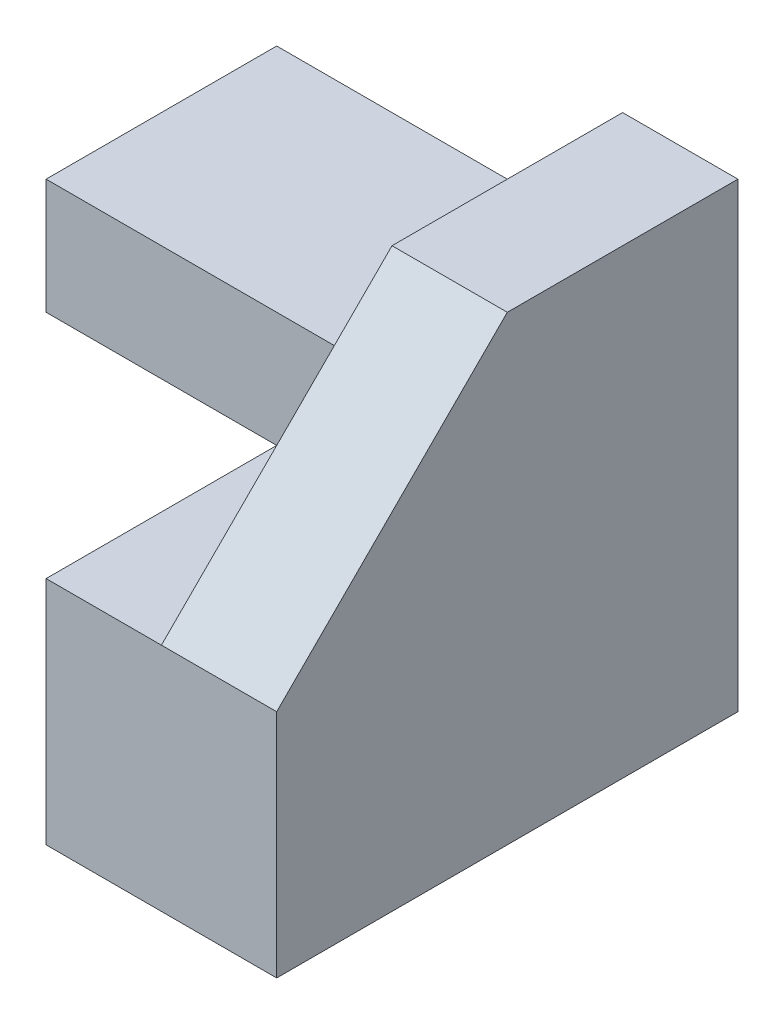
ISO-10303-21;
HEADER;
FILE_DESCRIPTION(('STEP AP214'),'2;1');
FILE_NAME('part.step','',(''),(''),'','','');
FILE_SCHEMA(('AUTOMOTIVE_DESIGN { 1 0 10303 214 1 1 1 1 }'));
ENDSEC;
DATA;
#1=APPLICATION_CONTEXT('core data for automotive mechanical design processes');
#2=APPLICATION_PROTOCOL_DEFINITION('international standard','automotive_design',2000,#1);
#3=PRODUCT_CONTEXT('',#1,'mechanical');
#4=PRODUCT('Part','Part','',(#3));
#5=PRODUCT_RELATED_PRODUCT_CATEGORY('part','',(#4));
#6=PRODUCT_DEFINITION_FORMATION('','',#4);
#7=PRODUCT_DEFINITION_CONTEXT('part definition',#1,'design');
#8=PRODUCT_DEFINITION('design','',#6,#7);
#9=PRODUCT_DEFINITION_SHAPE('','',#8);
#10=(LENGTH_UNIT() NAMED_UNIT(*) SI_UNIT(.MILLI.,.METRE.));
#11=(NAMED_UNIT(*) PLANE_ANGLE_UNIT() SI_UNIT($,.RADIAN.));
#12=(NAMED_UNIT(*) SI_UNIT($,.STERADIAN.) SOLID_ANGLE_UNIT());
#13=UNCERTAINTY_MEASURE_WITH_UNIT(LENGTH_MEASURE(1.E-05),#10,'distance_accuracy_value','');
#14=(GEOMETRIC_REPRESENTATION_CONTEXT(3) GLOBAL_UNCERTAINTY_ASSIGNED_CONTEXT((#13)) GLOBAL_UNIT_ASSIGNED_CONTEXT((#10,
#11,#12)) REPRESENTATION_CONTEXT('',''));
#15=CARTESIAN_POINT('',(0.,0.,0.));
#16=DIRECTION('',(0.,0.,1.));
#17=DIRECTION('',(1.,0.,0.));
#18=AXIS2_PLACEMENT_3D('',#15,#16,#17);
#19=CARTESIAN_POINT('',(0.,2.,4.));
#20=DIRECTION('',(0.,-1.,0.));
#21=DIRECTION('',(0.,0.,-1.));
#22=AXIS2_PLACEMENT_3D('',#19,#20,#21);
#23=PLANE('',#22);
#24=DIRECTION('',(-1.,0.,0.));
#25=VECTOR('',#24,1.);
#26=CARTESIAN_POINT('',(0.,2.,4.));
#27=LINE('',#26,#25);
#28=CARTESIAN_POINT('',(1.,2.,4.));
#29=VERTEX_POINT('',#28);
#30=CARTESIAN_POINT('',(0.,2.,4.));
#31=VERTEX_POINT('',#30);
#32=EDGE_CURVE('E50',#29,#31,#27,.T.);
#33=ORIENTED_EDGE('',*,*,#32,.F.);
#34=DIRECTION('',(0.,0.,-1.));
#35=VECTOR('',#34,1.);
#36=CARTESIAN_POINT('',(1.,2.,4.));
#37=LINE('',#36,#35);
#38=CARTESIAN_POINT('',(1.,2.,2.));
#39=VERTEX_POINT('',#38);
#40=EDGE_CURVE('E231',#29,#39,#37,.T.);
#41=ORIENTED_EDGE('',*,*,#40,.T.);
#42=DIRECTION('',(-1.,0.,0.));
#43=VECTOR('',#42,1.);
#44=CARTESIAN_POINT('',(1.,2.,2.));
#45=LINE('',#44,#43);
#46=CARTESIAN_POINT('',(0.,2.,2.));
#47=VERTEX_POINT('',#46);
#48=EDGE_CURVE('E173',#39,#47,#45,.T.);
#49=ORIENTED_EDGE('',*,*,#48,.T.);
#50=DIRECTION('',(0.,0.,-1.));
#51=VECTOR('',#50,1.);
#52=CARTESIAN_POINT('',(0.,2.,4.));
#53=LINE('',#52,#51);
#54=EDGE_CURVE('E94',#31,#47,#53,.T.);
#55=ORIENTED_EDGE('',*,*,#54,.F.);
#56=EDGE_LOOP('',(#33,#41,#49,#55));
#57=FACE_BOUND('',#56,.T.);
#58=ADVANCED_FACE('F33',(#57),#23,.F.);
#59=CARTESIAN_POINT('',(0.,0.,4.));
#60=DIRECTION('',(1.,0.,0.));
#61=DIRECTION('',(0.,0.,-1.));
#62=AXIS2_PLACEMENT_3D('',#59,#60,#61);
#63=PLANE('',#62);
#64=ORIENTED_EDGE('',*,*,#54,.T.);
#65=DIRECTION('',(0.,-0.447213595499958,-0.894427190999916));
#66=VECTOR('',#65,1.);
#67=CARTESIAN_POINT('',(0.,2.4,2.8));
#68=LINE('',#67,#66);
#69=CARTESIAN_POINT('',(0.,1.,0.));
#70=VERTEX_POINT('',#69);
#71=EDGE_CURVE('E166',#47,#70,#68,.T.);
#72=ORIENTED_EDGE('',*,*,#71,.T.);
#73=DIRECTION('',(0.,-1.,0.));
#74=VECTOR('',#73,1.);
#75=CARTESIAN_POINT('',(0.,0.,0.));
#76=LINE('',#75,#74);
#77=CARTESIAN_POINT('',(0.,0.,0.));
#78=VERTEX_POINT('',#77);
#79=EDGE_CURVE('E63',#70,#78,#76,.T.);
#80=ORIENTED_EDGE('',*,*,#79,.T.);
#81=DIRECTION('',(0.,0.,-1.));
#82=VECTOR('',#81,1.);
#83=CARTESIAN_POINT('',(0.,0.,4.));
#84=LINE('',#83,#82);
#85=CARTESIAN_POINT('',(0.,0.,4.));
#86=VERTEX_POINT('',#85);
#87=EDGE_CURVE('E11',#86,#78,#84,.T.);
#88=ORIENTED_EDGE('',*,*,#87,.F.);
#89=DIRECTION('',(0.,-1.,0.));
#90=VECTOR('',#89,1.);
#91=CARTESIAN_POINT('',(0.,0.,4.));
#92=LINE('',#91,#90);
#93=EDGE_CURVE('E87',#31,#86,#92,.T.);
#94=ORIENTED_EDGE('',*,*,#93,.F.);
#95=EDGE_LOOP('',(#64,#72,#80,#88,#94));
#96=FACE_BOUND('',#95,.T.);
#97=ADVANCED_FACE('F35',(#96),#63,.F.);
#98=CARTESIAN_POINT('',(0.,0.,4.));
#99=DIRECTION('',(0.,1.,0.));
#100=DIRECTION('',(0.,0.,1.));
#101=AXIS2_PLACEMENT_3D('',#98,#99,#100);
#102=PLANE('',#101);
#103=DIRECTION('',(1.,0.,0.));
#104=VECTOR('',#103,1.);
#105=CARTESIAN_POINT('',(0.,0.,0.));
#106=LINE('',#105,#104);
#107=CARTESIAN_POINT('',(2.,0.,0.));
#108=VERTEX_POINT('',#107);
#109=EDGE_CURVE('E129',#78,#108,#106,.T.);
#110=ORIENTED_EDGE('',*,*,#109,.T.);
#111=DIRECTION('',(0.,0.,-1.));
#112=VECTOR('',#111,1.);
#113=CARTESIAN_POINT('',(2.,0.,4.));
#114=LINE('',#113,#112);
#115=CARTESIAN_POINT('',(2.,0.,4.));
#116=VERTEX_POINT('',#115);
#117=EDGE_CURVE('E42',#116,#108,#114,.T.);
#118=ORIENTED_EDGE('',*,*,#117,.F.);
#119=DIRECTION('',(1.,0.,0.));
#120=VECTOR('',#119,1.);
#121=CARTESIAN_POINT('',(0.,0.,4.));
#122=LINE('',#121,#120);
#123=EDGE_CURVE('E81',#86,#116,#122,.T.);
#124=ORIENTED_EDGE('',*,*,#123,.F.);
#125=ORIENTED_EDGE('',*,*,#87,.T.);
#126=EDGE_LOOP('',(#110,#118,#124,#125));
#127=FACE_BOUND('',#126,.T.);
#128=ADVANCED_FACE('F82',(#127),#102,.F.);
#129=CARTESIAN_POINT('',(2.,0.,4.));
#130=DIRECTION('',(-1.,0.,0.));
#131=DIRECTION('',(0.,0.,1.));
#132=AXIS2_PLACEMENT_3D('',#129,#130,#131);
#133=PLANE('',#132);
#134=DIRECTION('',(0.,1.,0.));
#135=VECTOR('',#134,1.);
#136=CARTESIAN_POINT('',(2.,0.,0.));
#137=LINE('',#136,#135);
#138=CARTESIAN_POINT('',(2.,4.,0.));
#139=VERTEX_POINT('',#138);
#140=EDGE_CURVE('E92',#108,#139,#137,.T.);
#141=ORIENTED_EDGE('',*,*,#140,.T.);
#142=DIRECTION('',(0.,0.,-1.));
#143=VECTOR('',#142,1.);
#144=CARTESIAN_POINT('',(2.,4.,2.));
#145=LINE('',#144,#143);
#146=CARTESIAN_POINT('',(2.,4.,2.));
#147=VERTEX_POINT('',#146);
#148=EDGE_CURVE('E124',#147,#139,#145,.T.);
#149=ORIENTED_EDGE('',*,*,#148,.F.);
#150=DIRECTION('',(0.,-0.707106781186548,0.707106781186548));
#151=VECTOR('',#150,1.);
#152=CARTESIAN_POINT('',(2.,4.,2.));
#153=LINE('',#152,#151);
#154=CARTESIAN_POINT('',(2.,2.,4.));
#155=VERTEX_POINT('',#154);
#156=EDGE_CURVE('E227',#147,#155,#153,.T.);
#157=ORIENTED_EDGE('',*,*,#156,.T.);
#158=DIRECTION('',(0.,1.,0.));
#159=VECTOR('',#158,1.);
#160=CARTESIAN_POINT('',(2.,0.,4.));
#161=LINE('',#160,#159);
#162=EDGE_CURVE('E86',#116,#155,#161,.T.);
#163=ORIENTED_EDGE('',*,*,#162,.F.);
#164=ORIENTED_EDGE('',*,*,#117,.T.);
#165=EDGE_LOOP('',(#141,#149,#157,#163,#164));
#166=FACE_BOUND('',#165,.T.);
#167=ADVANCED_FACE('F100',(#166),#133,.F.);
#168=CARTESIAN_POINT('',(0.,0.,4.));
#169=DIRECTION('',(0.,0.,-1.));
#170=DIRECTION('',(-1.,0.,0.));
#171=AXIS2_PLACEMENT_3D('',#168,#169,#170);
#172=PLANE('',#171);
#173=ORIENTED_EDGE('',*,*,#93,.T.);
#174=ORIENTED_EDGE('',*,*,#123,.T.);
#175=ORIENTED_EDGE('',*,*,#162,.T.);
#176=EDGE_CURVE('E177',#155,#29,#27,.T.);
#177=ORIENTED_EDGE('',*,*,#176,.T.);
#178=ORIENTED_EDGE('',*,*,#32,.T.);
#179=EDGE_LOOP('',(#173,#174,#175,#177,#178));
#180=FACE_BOUND('',#179,.T.);
#181=ADVANCED_FACE('F90',(#180),#172,.F.);
#182=CARTESIAN_POINT('',(0.,0.,0.));
#183=DIRECTION('',(0.,0.,-1.));
#184=DIRECTION('',(-1.,0.,0.));
#185=AXIS2_PLACEMENT_3D('',#182,#183,#184);
#186=PLANE('',#185);
#187=ORIENTED_EDGE('',*,*,#79,.F.);
#188=DIRECTION('',(-1.,0.,0.));
#189=VECTOR('',#188,1.);
#190=CARTESIAN_POINT('',(1.,1.,0.));
#191=LINE('',#190,#189);
#192=CARTESIAN_POINT('',(-2.,1.,0.));
#193=VERTEX_POINT('',#192);
#194=EDGE_CURVE('E73',#70,#193,#191,.T.);
#195=ORIENTED_EDGE('',*,*,#194,.T.);
#196=DIRECTION('',(0.,-1.,0.));
#197=VECTOR('',#196,1.);
#198=CARTESIAN_POINT('',(-2.,1.,0.));
#199=LINE('',#198,#197);
#200=CARTESIAN_POINT('',(-2.,3.,0.));
#201=VERTEX_POINT('',#200);
#202=EDGE_CURVE('E158',#201,#193,#199,.T.);
#203=ORIENTED_EDGE('',*,*,#202,.F.);
#204=DIRECTION('',(-1.,0.,0.));
#205=VECTOR('',#204,1.);
#206=CARTESIAN_POINT('',(1.,3.,0.));
#207=LINE('',#206,#205);
#208=CARTESIAN_POINT('',(1.,3.,0.));
#209=VERTEX_POINT('',#208);
#210=EDGE_CURVE('E167',#209,#201,#207,.T.);
#211=ORIENTED_EDGE('',*,*,#210,.F.);
#212=DIRECTION('',(0.,-1.,0.));
#213=VECTOR('',#212,1.);
#214=CARTESIAN_POINT('',(1.,4.,0.));
#215=LINE('',#214,#213);
#216=CARTESIAN_POINT('',(1.,4.,0.));
#217=VERTEX_POINT('',#216);
#218=EDGE_CURVE('E143',#217,#209,#215,.T.);
#219=ORIENTED_EDGE('',*,*,#218,.F.);
#220=DIRECTION('',(-1.,0.,0.));
#221=VECTOR('',#220,1.);
#222=CARTESIAN_POINT('',(1.,4.,0.));
#223=LINE('',#222,#221);
#224=EDGE_CURVE('E136',#139,#217,#223,.T.);
#225=ORIENTED_EDGE('',*,*,#224,.F.);
#226=ORIENTED_EDGE('',*,*,#140,.F.);
#227=ORIENTED_EDGE('',*,*,#109,.F.);
#228=EDGE_LOOP('',(#187,#195,#203,#211,#219,#225,#226,#227));
#229=FACE_BOUND('',#228,.T.);
#230=ADVANCED_FACE('F109',(#229),#186,.T.);
#231=CARTESIAN_POINT('',(1.,2.,2.));
#232=DIRECTION('',(0.,-0.894427190999916,0.447213595499958));
#233=DIRECTION('',(0.,-0.447213595499958,-0.894427190999916));
#234=AXIS2_PLACEMENT_3D('',#231,#232,#233);
#235=PLANE('',#234);
#236=ORIENTED_EDGE('',*,*,#71,.F.);
#237=CARTESIAN_POINT('',(-2.,2.,2.));
#238=VERTEX_POINT('',#237);
#239=EDGE_CURVE('E164',#47,#238,#45,.T.);
#240=ORIENTED_EDGE('',*,*,#239,.T.);
#241=DIRECTION('',(0.,0.447213595499958,0.894427190999916));
#242=VECTOR('',#241,1.);
#243=CARTESIAN_POINT('',(-2.,2.,2.));
#244=LINE('',#243,#242);
#245=EDGE_CURVE('E146',#193,#238,#244,.T.);
#246=ORIENTED_EDGE('',*,*,#245,.F.);
#247=ORIENTED_EDGE('',*,*,#194,.F.);
#248=EDGE_LOOP('',(#236,#240,#246,#247));
#249=FACE_BOUND('',#248,.T.);
#250=ADVANCED_FACE('F188',(#249),#235,.T.);
#251=CARTESIAN_POINT('',(1.,3.,0.));
#252=DIRECTION('',(0.,1.,0.));
#253=DIRECTION('',(0.,0.,1.));
#254=AXIS2_PLACEMENT_3D('',#251,#252,#253);
#255=PLANE('',#254);
#256=ORIENTED_EDGE('',*,*,#210,.T.);
#257=DIRECTION('',(0.,0.,-1.));
#258=VECTOR('',#257,1.);
#259=CARTESIAN_POINT('',(-2.,3.,0.));
#260=LINE('',#259,#258);
#261=CARTESIAN_POINT('',(-2.,3.,2.));
#262=VERTEX_POINT('',#261);
#263=EDGE_CURVE('E155',#262,#201,#260,.T.);
#264=ORIENTED_EDGE('',*,*,#263,.F.);
#265=DIRECTION('',(-1.,0.,0.));
#266=VECTOR('',#265,1.);
#267=CARTESIAN_POINT('',(1.,3.,2.));
#268=LINE('',#267,#266);
#269=CARTESIAN_POINT('',(1.,3.,2.));
#270=VERTEX_POINT('',#269);
#271=EDGE_CURVE('E170',#270,#262,#268,.T.);
#272=ORIENTED_EDGE('',*,*,#271,.F.);
#273=DIRECTION('',(0.,0.,-1.));
#274=VECTOR('',#273,1.);
#275=CARTESIAN_POINT('',(1.,3.,0.));
#276=LINE('',#275,#274);
#277=EDGE_CURVE('E161',#270,#209,#276,.T.);
#278=ORIENTED_EDGE('',*,*,#277,.T.);
#279=EDGE_LOOP('',(#256,#264,#272,#278));
#280=FACE_BOUND('',#279,.T.);
#281=ADVANCED_FACE('F201',(#280),#255,.T.);
#282=CARTESIAN_POINT('',(1.,3.,2.));
#283=DIRECTION('',(0.,0.,1.));
#284=DIRECTION('',(1.,0.,0.));
#285=AXIS2_PLACEMENT_3D('',#282,#283,#284);
#286=PLANE('',#285);
#287=DIRECTION('',(0.,1.,0.));
#288=VECTOR('',#287,1.);
#289=CARTESIAN_POINT('',(1.,2.,2.));
#290=LINE('',#289,#288);
#291=EDGE_CURVE('E232',#39,#270,#290,.T.);
#292=ORIENTED_EDGE('',*,*,#291,.T.);
#293=ORIENTED_EDGE('',*,*,#271,.T.);
#294=DIRECTION('',(0.,1.,0.));
#295=VECTOR('',#294,1.);
#296=CARTESIAN_POINT('',(-2.,3.,2.));
#297=LINE('',#296,#295);
#298=EDGE_CURVE('E152',#238,#262,#297,.T.);
#299=ORIENTED_EDGE('',*,*,#298,.F.);
#300=ORIENTED_EDGE('',*,*,#239,.F.);
#301=ORIENTED_EDGE('',*,*,#48,.F.);
#302=EDGE_LOOP('',(#292,#293,#299,#300,#301));
#303=FACE_BOUND('',#302,.T.);
#304=ADVANCED_FACE('F197',(#303),#286,.T.);
#305=CARTESIAN_POINT('',(-2.,0.,0.));
#306=DIRECTION('',(1.,0.,0.));
#307=DIRECTION('',(0.,0.,-1.));
#308=AXIS2_PLACEMENT_3D('',#305,#306,#307);
#309=PLANE('',#308);
#310=ORIENTED_EDGE('',*,*,#245,.T.);
#311=ORIENTED_EDGE('',*,*,#298,.T.);
#312=ORIENTED_EDGE('',*,*,#263,.T.);
#313=ORIENTED_EDGE('',*,*,#202,.T.);
#314=EDGE_LOOP('',(#310,#311,#312,#313));
#315=FACE_BOUND('',#314,.T.);
#316=ADVANCED_FACE('F184',(#315),#309,.F.);
#317=CARTESIAN_POINT('',(1.,4.,2.));
#318=DIRECTION('',(1.,0.,0.));
#319=DIRECTION('',(0.,0.,-1.));
#320=AXIS2_PLACEMENT_3D('',#317,#318,#319);
#321=PLANE('',#320);
#322=ORIENTED_EDGE('',*,*,#277,.F.);
#323=ORIENTED_EDGE('',*,*,#291,.F.);
#324=ORIENTED_EDGE('',*,*,#40,.F.);
#325=DIRECTION('',(0.,-0.707106781186548,0.707106781186548));
#326=VECTOR('',#325,1.);
#327=CARTESIAN_POINT('',(1.,4.,2.));
#328=LINE('',#327,#326);
#329=CARTESIAN_POINT('',(1.,4.,2.));
#330=VERTEX_POINT('',#329);
#331=EDGE_CURVE('E225',#330,#29,#328,.T.);
#332=ORIENTED_EDGE('',*,*,#331,.F.);
#333=DIRECTION('',(0.,0.,1.));
#334=VECTOR('',#333,1.);
#335=CARTESIAN_POINT('',(1.,4.,2.));
#336=LINE('',#335,#334);
#337=EDGE_CURVE('E228',#217,#330,#336,.T.);
#338=ORIENTED_EDGE('',*,*,#337,.F.);
#339=ORIENTED_EDGE('',*,*,#218,.T.);
#340=EDGE_LOOP('',(#322,#323,#324,#332,#338,#339));
#341=FACE_BOUND('',#340,.T.);
#342=ADVANCED_FACE('F229',(#341),#321,.F.);
#343=CARTESIAN_POINT('',(0.,4.,0.));
#344=DIRECTION('',(0.,-1.,0.));
#345=DIRECTION('',(0.,0.,-1.));
#346=AXIS2_PLACEMENT_3D('',#343,#344,#345);
#347=PLANE('',#346);
#348=ORIENTED_EDGE('',*,*,#337,.T.);
#349=DIRECTION('',(1.,0.,0.));
#350=VECTOR('',#349,1.);
#351=CARTESIAN_POINT('',(1.,4.,2.));
#352=LINE('',#351,#350);
#353=EDGE_CURVE('E139',#330,#147,#352,.T.);
#354=ORIENTED_EDGE('',*,*,#353,.T.);
#355=ORIENTED_EDGE('',*,*,#148,.T.);
#356=ORIENTED_EDGE('',*,*,#224,.T.);
#357=EDGE_LOOP('',(#348,#354,#355,#356));
#358=FACE_BOUND('',#357,.T.);
#359=ADVANCED_FACE('F135',(#358),#347,.F.);
#360=CARTESIAN_POINT('',(1.,4.,2.));
#361=DIRECTION('',(0.,0.707106781186547,0.707106781186547));
#362=DIRECTION('',(0.,-0.707106781186548,0.707106781186548));
#363=AXIS2_PLACEMENT_3D('',#360,#361,#362);
#364=PLANE('',#363);
#365=ORIENTED_EDGE('',*,*,#156,.F.);
#366=ORIENTED_EDGE('',*,*,#353,.F.);
#367=ORIENTED_EDGE('',*,*,#331,.T.);
#368=ORIENTED_EDGE('',*,*,#176,.F.);
#369=EDGE_LOOP('',(#365,#366,#367,#368));
#370=FACE_BOUND('',#369,.T.);
#371=ADVANCED_FACE('F224',(#370),#364,.T.);
#372=CLOSED_SHELL('',(#58,#97,#128,#167,#181,#230,#250,#281,#304,#316,#342,#359,#371));
#373=MANIFOLD_SOLID_BREP('B2',#372);
#374=ADVANCED_BREP_SHAPE_REPRESENTATION('',(#18,#373),#14);
#375=SHAPE_DEFINITION_REPRESENTATION(#9,#374);
ENDSEC;
END-ISO-10303-21;
